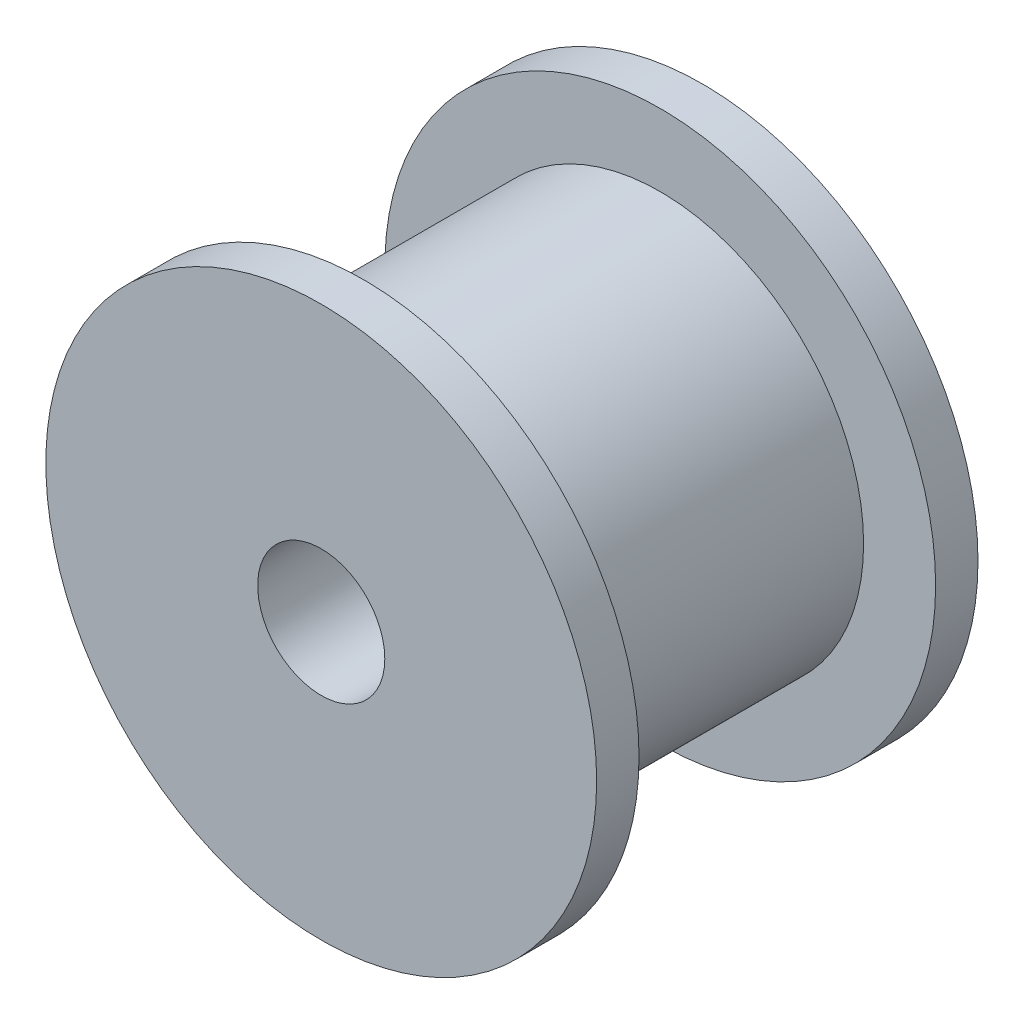
ISO-10303-21;
HEADER;
FILE_DESCRIPTION(('STEP AP214'),'2;1');
FILE_NAME('part.step','',(''),(''),'','','');
FILE_SCHEMA(('AUTOMOTIVE_DESIGN { 1 0 10303 214 1 1 1 1 }'));
ENDSEC;
DATA;
#1=APPLICATION_CONTEXT('core data for automotive mechanical design processes');
#2=APPLICATION_PROTOCOL_DEFINITION('international standard','automotive_design',2000,#1);
#3=PRODUCT_CONTEXT('',#1,'mechanical');
#4=PRODUCT('Part','Part','',(#3));
#5=PRODUCT_RELATED_PRODUCT_CATEGORY('part','',(#4));
#6=PRODUCT_DEFINITION_FORMATION('','',#4);
#7=PRODUCT_DEFINITION_CONTEXT('part definition',#1,'design');
#8=PRODUCT_DEFINITION('design','',#6,#7);
#9=PRODUCT_DEFINITION_SHAPE('','',#8);
#10=(LENGTH_UNIT() NAMED_UNIT(*) SI_UNIT(.MILLI.,.METRE.));
#11=(NAMED_UNIT(*) PLANE_ANGLE_UNIT() SI_UNIT($,.RADIAN.));
#12=(NAMED_UNIT(*) SI_UNIT($,.STERADIAN.) SOLID_ANGLE_UNIT());
#13=UNCERTAINTY_MEASURE_WITH_UNIT(LENGTH_MEASURE(1.E-05),#10,'distance_accuracy_value','');
#14=(GEOMETRIC_REPRESENTATION_CONTEXT(3) GLOBAL_UNCERTAINTY_ASSIGNED_CONTEXT((#13)) GLOBAL_UNIT_ASSIGNED_CONTEXT((#10,
#11,#12)) REPRESENTATION_CONTEXT('',''));
#15=CARTESIAN_POINT('',(0.,0.,0.));
#16=DIRECTION('',(0.,0.,1.));
#17=DIRECTION('',(1.,0.,0.));
#18=AXIS2_PLACEMENT_3D('',#15,#16,#17);
#19=CARTESIAN_POINT('',(0.,0.,1.));
#20=DIRECTION('',(0.,0.,1.));
#21=DIRECTION('',(1.,0.,0.));
#22=AXIS2_PLACEMENT_3D('',#19,#20,#21);
#23=PLANE('',#22);
#24=CARTESIAN_POINT('',(0.,0.,1.));
#25=DIRECTION('',(0.,0.,1.));
#26=DIRECTION('',(1.,0.,0.));
#27=AXIS2_PLACEMENT_3D('',#24,#25,#26);
#28=CIRCLE('',#27,4.8);
#29=CARTESIAN_POINT('',(4.8,0.,1.));
#30=VERTEX_POINT('',#29);
#31=EDGE_CURVE('E10',#30,#30,#28,.T.);
#32=ORIENTED_EDGE('',*,*,#31,.F.);
#33=EDGE_LOOP('',(#32));
#34=FACE_BOUND('',#33,.T.);
#35=CARTESIAN_POINT('',(0.,0.,1.));
#36=DIRECTION('',(0.,0.,1.));
#37=DIRECTION('',(1.,0.,0.));
#38=AXIS2_PLACEMENT_3D('',#35,#36,#37);
#39=CIRCLE('',#38,6.5);
#40=CARTESIAN_POINT('',(6.5,0.,1.));
#41=VERTEX_POINT('',#40);
#42=EDGE_CURVE('E42',#41,#41,#39,.T.);
#43=ORIENTED_EDGE('',*,*,#42,.T.);
#44=EDGE_LOOP('',(#43));
#45=FACE_BOUND('',#44,.T.);
#46=ADVANCED_FACE('F34',(#34,#45),#23,.T.);
#47=CARTESIAN_POINT('',(0.,0.,0.));
#48=DIRECTION('',(0.,0.,1.));
#49=DIRECTION('',(1.,0.,0.));
#50=AXIS2_PLACEMENT_3D('',#47,#48,#49);
#51=PLANE('',#50);
#52=CARTESIAN_POINT('',(0.,0.,0.));
#53=DIRECTION('',(0.,0.,1.));
#54=DIRECTION('',(1.,0.,0.));
#55=AXIS2_PLACEMENT_3D('',#52,#53,#54);
#56=CIRCLE('',#55,6.5);
#57=CARTESIAN_POINT('',(6.5,0.,0.));
#58=VERTEX_POINT('',#57);
#59=EDGE_CURVE('E38',#58,#58,#56,.T.);
#60=ORIENTED_EDGE('',*,*,#59,.F.);
#61=EDGE_LOOP('',(#60));
#62=FACE_BOUND('',#61,.T.);
#63=CARTESIAN_POINT('',(0.,0.,0.));
#64=DIRECTION('',(0.,0.,1.));
#65=DIRECTION('',(1.,0.,0.));
#66=AXIS2_PLACEMENT_3D('',#63,#64,#65);
#67=CIRCLE('',#66,1.5);
#68=CARTESIAN_POINT('',(1.5,0.,0.));
#69=VERTEX_POINT('',#68);
#70=EDGE_CURVE('E51',#69,#69,#67,.T.);
#71=ORIENTED_EDGE('',*,*,#70,.T.);
#72=EDGE_LOOP('',(#71));
#73=FACE_BOUND('',#72,.T.);
#74=ADVANCED_FACE('F87',(#62,#73),#51,.F.);
#75=CARTESIAN_POINT('',(0.,0.,1.));
#76=DIRECTION('',(0.,0.,-1.));
#77=DIRECTION('',(-1.,0.,0.));
#78=AXIS2_PLACEMENT_3D('',#75,#76,#77);
#79=CYLINDRICAL_SURFACE('',#78,6.5);
#80=ORIENTED_EDGE('',*,*,#42,.F.);
#81=EDGE_LOOP('',(#80));
#82=FACE_BOUND('',#81,.T.);
#83=ORIENTED_EDGE('',*,*,#59,.T.);
#84=EDGE_LOOP('',(#83));
#85=FACE_BOUND('',#84,.T.);
#86=ADVANCED_FACE('F36',(#82,#85),#79,.T.);
#87=CARTESIAN_POINT('',(0.,0.,1.));
#88=DIRECTION('',(0.,0.,-1.));
#89=DIRECTION('',(-1.,0.,0.));
#90=AXIS2_PLACEMENT_3D('',#87,#88,#89);
#91=CYLINDRICAL_SURFACE('',#90,1.5);
#92=ORIENTED_EDGE('',*,*,#70,.F.);
#93=EDGE_LOOP('',(#92));
#94=FACE_BOUND('',#93,.T.);
#95=CARTESIAN_POINT('',(0.,0.,9.));
#96=DIRECTION('',(0.,0.,1.));
#97=DIRECTION('',(1.,0.,0.));
#98=AXIS2_PLACEMENT_3D('',#95,#96,#97);
#99=CIRCLE('',#98,1.5);
#100=CARTESIAN_POINT('',(1.5,0.,9.));
#101=VERTEX_POINT('',#100);
#102=EDGE_CURVE('E66',#101,#101,#99,.T.);
#103=ORIENTED_EDGE('',*,*,#102,.T.);
#104=EDGE_LOOP('',(#103));
#105=FACE_BOUND('',#104,.T.);
#106=ADVANCED_FACE('F71',(#94,#105),#91,.F.);
#107=CARTESIAN_POINT('',(0.,0.,8.));
#108=DIRECTION('',(0.,0.,-1.));
#109=DIRECTION('',(-1.,0.,0.));
#110=AXIS2_PLACEMENT_3D('',#107,#108,#109);
#111=CYLINDRICAL_SURFACE('',#110,4.8);
#112=CARTESIAN_POINT('',(0.,0.,8.));
#113=DIRECTION('',(0.,0.,1.));
#114=DIRECTION('',(1.,0.,0.));
#115=AXIS2_PLACEMENT_3D('',#112,#113,#114);
#116=CIRCLE('',#115,4.8);
#117=CARTESIAN_POINT('',(4.8,0.,8.));
#118=VERTEX_POINT('',#117);
#119=EDGE_CURVE('E49',#118,#118,#116,.T.);
#120=ORIENTED_EDGE('',*,*,#119,.F.);
#121=EDGE_LOOP('',(#120));
#122=FACE_BOUND('',#121,.T.);
#123=ORIENTED_EDGE('',*,*,#31,.T.);
#124=EDGE_LOOP('',(#123));
#125=FACE_BOUND('',#124,.T.);
#126=ADVANCED_FACE('F76',(#122,#125),#111,.T.);
#127=CARTESIAN_POINT('',(0.,0.,9.));
#128=DIRECTION('',(0.,0.,1.));
#129=DIRECTION('',(1.,0.,0.));
#130=AXIS2_PLACEMENT_3D('',#127,#128,#129);
#131=PLANE('',#130);
#132=CARTESIAN_POINT('',(0.,0.,9.));
#133=DIRECTION('',(0.,0.,1.));
#134=DIRECTION('',(1.,0.,0.));
#135=AXIS2_PLACEMENT_3D('',#132,#133,#134);
#136=CIRCLE('',#135,6.5);
#137=CARTESIAN_POINT('',(6.5,0.,9.));
#138=VERTEX_POINT('',#137);
#139=EDGE_CURVE('E57',#138,#138,#136,.T.);
#140=ORIENTED_EDGE('',*,*,#139,.T.);
#141=EDGE_LOOP('',(#140));
#142=FACE_BOUND('',#141,.T.);
#143=ORIENTED_EDGE('',*,*,#102,.F.);
#144=EDGE_LOOP('',(#143));
#145=FACE_BOUND('',#144,.T.);
#146=ADVANCED_FACE('F73',(#142,#145),#131,.T.);
#147=CARTESIAN_POINT('',(0.,0.,8.));
#148=DIRECTION('',(0.,0.,1.));
#149=DIRECTION('',(1.,0.,0.));
#150=AXIS2_PLACEMENT_3D('',#147,#148,#149);
#151=PLANE('',#150);
#152=ORIENTED_EDGE('',*,*,#119,.T.);
#153=EDGE_LOOP('',(#152));
#154=FACE_BOUND('',#153,.T.);
#155=CARTESIAN_POINT('',(0.,0.,8.));
#156=DIRECTION('',(0.,0.,1.));
#157=DIRECTION('',(1.,0.,0.));
#158=AXIS2_PLACEMENT_3D('',#155,#156,#157);
#159=CIRCLE('',#158,6.5);
#160=CARTESIAN_POINT('',(6.5,0.,8.));
#161=VERTEX_POINT('',#160);
#162=EDGE_CURVE('E61',#161,#161,#159,.T.);
#163=ORIENTED_EDGE('',*,*,#162,.F.);
#164=EDGE_LOOP('',(#163));
#165=FACE_BOUND('',#164,.T.);
#166=ADVANCED_FACE('F75',(#154,#165),#151,.F.);
#167=CARTESIAN_POINT('',(0.,0.,9.));
#168=DIRECTION('',(0.,0.,-1.));
#169=DIRECTION('',(-1.,0.,0.));
#170=AXIS2_PLACEMENT_3D('',#167,#168,#169);
#171=CYLINDRICAL_SURFACE('',#170,6.5);
#172=ORIENTED_EDGE('',*,*,#139,.F.);
#173=EDGE_LOOP('',(#172));
#174=FACE_BOUND('',#173,.T.);
#175=ORIENTED_EDGE('',*,*,#162,.T.);
#176=EDGE_LOOP('',(#175));
#177=FACE_BOUND('',#176,.T.);
#178=ADVANCED_FACE('F82',(#174,#177),#171,.T.);
#179=CLOSED_SHELL('',(#46,#74,#86,#106,#126,#146,#166,#178));
#180=MANIFOLD_SOLID_BREP('B2',#179);
#181=ADVANCED_BREP_SHAPE_REPRESENTATION('',(#18,#180),#14);
#182=SHAPE_DEFINITION_REPRESENTATION(#9,#181);
ENDSEC;
END-ISO-10303-21;
